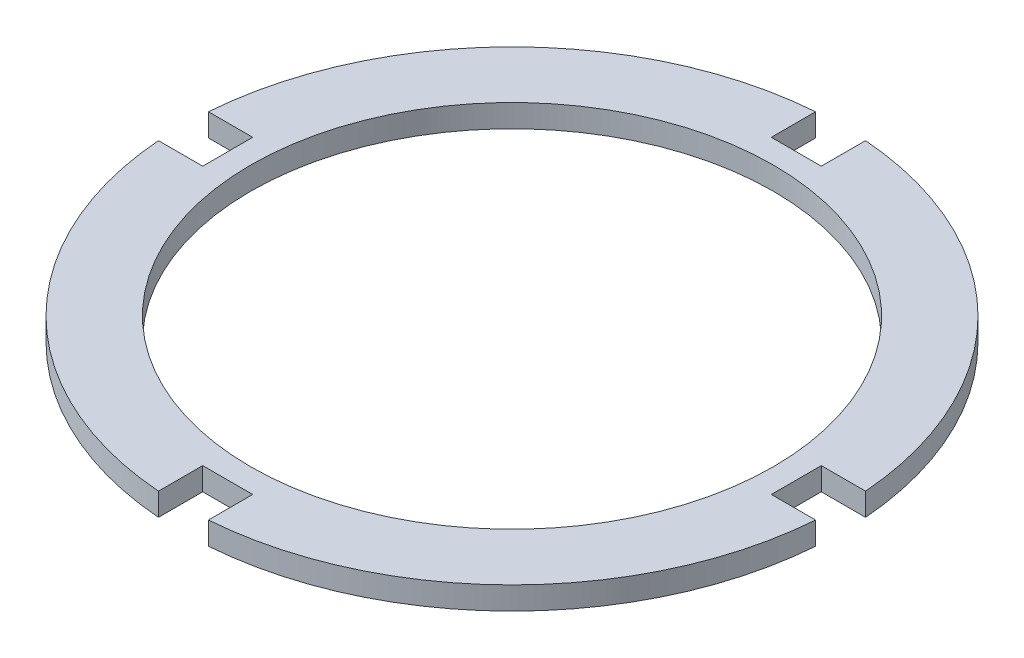
ISO-10303-21;
HEADER;
FILE_DESCRIPTION(('STEP AP214'),'2;1');
FILE_NAME('part.step','',(''),(''),'','','');
FILE_SCHEMA(('AUTOMOTIVE_DESIGN { 1 0 10303 214 1 1 1 1 }'));
ENDSEC;
DATA;
#1=APPLICATION_CONTEXT('core data for automotive mechanical design processes');
#2=APPLICATION_PROTOCOL_DEFINITION('international standard','automotive_design',2000,#1);
#3=PRODUCT_CONTEXT('',#1,'mechanical');
#4=PRODUCT('Part','Part','',(#3));
#5=PRODUCT_RELATED_PRODUCT_CATEGORY('part','',(#4));
#6=PRODUCT_DEFINITION_FORMATION('','',#4);
#7=PRODUCT_DEFINITION_CONTEXT('part definition',#1,'design');
#8=PRODUCT_DEFINITION('design','',#6,#7);
#9=PRODUCT_DEFINITION_SHAPE('','',#8);
#10=(LENGTH_UNIT() NAMED_UNIT(*) SI_UNIT(.MILLI.,.METRE.));
#11=(NAMED_UNIT(*) PLANE_ANGLE_UNIT() SI_UNIT($,.RADIAN.));
#12=(NAMED_UNIT(*) SI_UNIT($,.STERADIAN.) SOLID_ANGLE_UNIT());
#13=UNCERTAINTY_MEASURE_WITH_UNIT(LENGTH_MEASURE(1.E-05),#10,'distance_accuracy_value','');
#14=(GEOMETRIC_REPRESENTATION_CONTEXT(3) GLOBAL_UNCERTAINTY_ASSIGNED_CONTEXT((#13)) GLOBAL_UNIT_ASSIGNED_CONTEXT((#10,
#11,#12)) REPRESENTATION_CONTEXT('',''));
#15=CARTESIAN_POINT('',(0.,0.,0.));
#16=DIRECTION('',(0.,0.,1.));
#17=DIRECTION('',(1.,0.,0.));
#18=AXIS2_PLACEMENT_3D('',#15,#16,#17);
#19=CARTESIAN_POINT('',(6.98500000000221,6.35,0.));
#20=DIRECTION('',(-1.,0.,0.));
#21=DIRECTION('',(0.,0.,1.));
#22=AXIS2_PLACEMENT_3D('',#19,#20,#21);
#23=PLANE('',#22);
#24=DIRECTION('',(0.,0.,-1.));
#25=VECTOR('',#24,1.);
#26=CARTESIAN_POINT('',(6.98500000000221,0.,0.));
#27=LINE('',#26,#25);
#28=CARTESIAN_POINT('',(6.98500000000223,0.,91.8096694253932));
#29=VERTEX_POINT('',#28);
#30=CARTESIAN_POINT('',(6.98500000000223,0.,79.4410399999999));
#31=VERTEX_POINT('',#30);
#32=EDGE_CURVE('E221',#29,#31,#27,.T.);
#33=ORIENTED_EDGE('',*,*,#32,.F.);
#34=DIRECTION('',(0.,-1.,0.));
#35=VECTOR('',#34,1.);
#36=CARTESIAN_POINT('',(6.98500000000223,6.35,91.8096694253932));
#37=LINE('',#36,#35);
#38=CARTESIAN_POINT('',(6.98500000000223,6.35,91.8096694253932));
#39=VERTEX_POINT('',#38);
#40=EDGE_CURVE('E11',#39,#29,#37,.T.);
#41=ORIENTED_EDGE('',*,*,#40,.F.);
#42=DIRECTION('',(0.,0.,-1.));
#43=VECTOR('',#42,1.);
#44=CARTESIAN_POINT('',(6.98500000000221,6.35,0.));
#45=LINE('',#44,#43);
#46=CARTESIAN_POINT('',(6.98500000000223,6.35,79.4410399999999));
#47=VERTEX_POINT('',#46);
#48=EDGE_CURVE('E333',#39,#47,#45,.T.);
#49=ORIENTED_EDGE('',*,*,#48,.T.);
#50=DIRECTION('',(0.,-1.,0.));
#51=VECTOR('',#50,1.);
#52=CARTESIAN_POINT('',(6.98500000000223,6.35,79.4410399999999));
#53=LINE('',#52,#51);
#54=EDGE_CURVE('E55',#47,#31,#53,.T.);
#55=ORIENTED_EDGE('',*,*,#54,.T.);
#56=EDGE_LOOP('',(#33,#41,#49,#55));
#57=FACE_BOUND('',#56,.T.);
#58=ADVANCED_FACE('F38',(#57),#23,.T.);
#59=CARTESIAN_POINT('',(0.,6.35,0.));
#60=DIRECTION('',(0.,-1.,0.));
#61=DIRECTION('',(0.,0.,-1.));
#62=AXIS2_PLACEMENT_3D('',#59,#60,#61);
#63=CYLINDRICAL_SURFACE('',#62,92.075);
#64=CARTESIAN_POINT('',(0.,0.,0.));
#65=DIRECTION('',(0.,1.,0.));
#66=DIRECTION('',(0.,0.,1.));
#67=AXIS2_PLACEMENT_3D('',#64,#65,#66);
#68=CIRCLE('',#67,92.075);
#69=CARTESIAN_POINT('',(91.8096694253934,0.,6.98499999999882));
#70=VERTEX_POINT('',#69);
#71=EDGE_CURVE('E218',#29,#70,#68,.T.);
#72=ORIENTED_EDGE('',*,*,#71,.T.);
#73=DIRECTION('',(0.,-1.,0.));
#74=VECTOR('',#73,1.);
#75=CARTESIAN_POINT('',(91.8096694253934,6.35,6.98499999999882));
#76=LINE('',#75,#74);
#77=CARTESIAN_POINT('',(91.8096694253934,6.35,6.98499999999882));
#78=VERTEX_POINT('',#77);
#79=EDGE_CURVE('E47',#78,#70,#76,.T.);
#80=ORIENTED_EDGE('',*,*,#79,.F.);
#81=CARTESIAN_POINT('',(0.,6.35,0.));
#82=DIRECTION('',(0.,1.,0.));
#83=DIRECTION('',(0.,0.,1.));
#84=AXIS2_PLACEMENT_3D('',#81,#82,#83);
#85=CIRCLE('',#84,92.075);
#86=EDGE_CURVE('E174',#39,#78,#85,.T.);
#87=ORIENTED_EDGE('',*,*,#86,.F.);
#88=ORIENTED_EDGE('',*,*,#40,.T.);
#89=EDGE_LOOP('',(#72,#80,#87,#88));
#90=FACE_BOUND('',#89,.T.);
#91=ADVANCED_FACE('F219',(#90),#63,.T.);
#92=CARTESIAN_POINT('',(0.,6.35,6.98499999999883));
#93=DIRECTION('',(0.,0.,1.));
#94=DIRECTION('',(1.,0.,0.));
#95=AXIS2_PLACEMENT_3D('',#92,#93,#94);
#96=PLANE('',#95);
#97=DIRECTION('',(-1.,0.,0.));
#98=VECTOR('',#97,1.);
#99=CARTESIAN_POINT('',(0.,0.,6.98499999999883));
#100=LINE('',#99,#98);
#101=CARTESIAN_POINT('',(79.441040000001,0.,6.98499999999882));
#102=VERTEX_POINT('',#101);
#103=EDGE_CURVE('E212',#70,#102,#100,.T.);
#104=ORIENTED_EDGE('',*,*,#103,.T.);
#105=DIRECTION('',(0.,-1.,0.));
#106=VECTOR('',#105,1.);
#107=CARTESIAN_POINT('',(79.441040000001,6.35,6.98499999999882));
#108=LINE('',#107,#106);
#109=CARTESIAN_POINT('',(79.441040000001,6.35,6.98499999999882));
#110=VERTEX_POINT('',#109);
#111=EDGE_CURVE('E204',#110,#102,#108,.T.);
#112=ORIENTED_EDGE('',*,*,#111,.F.);
#113=DIRECTION('',(-1.,0.,0.));
#114=VECTOR('',#113,1.);
#115=CARTESIAN_POINT('',(0.,6.35,6.98499999999883));
#116=LINE('',#115,#114);
#117=EDGE_CURVE('E214',#78,#110,#116,.T.);
#118=ORIENTED_EDGE('',*,*,#117,.F.);
#119=ORIENTED_EDGE('',*,*,#79,.T.);
#120=EDGE_LOOP('',(#104,#112,#118,#119));
#121=FACE_BOUND('',#120,.T.);
#122=ADVANCED_FACE('F210',(#121),#96,.F.);
#123=CARTESIAN_POINT('',(79.441040000001,6.35,0.));
#124=DIRECTION('',(1.,0.,0.));
#125=DIRECTION('',(0.,0.,-1.));
#126=AXIS2_PLACEMENT_3D('',#123,#124,#125);
#127=PLANE('',#126);
#128=DIRECTION('',(0.,0.,1.));
#129=VECTOR('',#128,1.);
#130=CARTESIAN_POINT('',(79.441040000001,0.,0.));
#131=LINE('',#130,#129);
#132=CARTESIAN_POINT('',(79.441040000001,0.,-6.98500000000118));
#133=VERTEX_POINT('',#132);
#134=EDGE_CURVE('E224',#133,#102,#131,.T.);
#135=ORIENTED_EDGE('',*,*,#134,.F.);
#136=DIRECTION('',(0.,-1.,0.));
#137=VECTOR('',#136,1.);
#138=CARTESIAN_POINT('',(79.441040000001,6.35,-6.98500000000118));
#139=LINE('',#138,#137);
#140=CARTESIAN_POINT('',(79.441040000001,6.35,-6.98500000000118));
#141=VERTEX_POINT('',#140);
#142=EDGE_CURVE('E202',#141,#133,#139,.T.);
#143=ORIENTED_EDGE('',*,*,#142,.F.);
#144=DIRECTION('',(0.,0.,1.));
#145=VECTOR('',#144,1.);
#146=CARTESIAN_POINT('',(79.441040000001,6.35,0.));
#147=LINE('',#146,#145);
#148=EDGE_CURVE('E339',#141,#110,#147,.T.);
#149=ORIENTED_EDGE('',*,*,#148,.T.);
#150=ORIENTED_EDGE('',*,*,#111,.T.);
#151=EDGE_LOOP('',(#135,#143,#149,#150));
#152=FACE_BOUND('',#151,.T.);
#153=ADVANCED_FACE('F292',(#152),#127,.T.);
#154=CARTESIAN_POINT('',(0.,6.35,-6.98500000000117));
#155=DIRECTION('',(0.,0.,1.));
#156=DIRECTION('',(1.,0.,0.));
#157=AXIS2_PLACEMENT_3D('',#154,#155,#156);
#158=PLANE('',#157);
#159=DIRECTION('',(-1.,0.,0.));
#160=VECTOR('',#159,1.);
#161=CARTESIAN_POINT('',(0.,0.,-6.98500000000117));
#162=LINE('',#161,#160);
#163=CARTESIAN_POINT('',(91.8096694253932,0.,-6.98500000000119));
#164=VERTEX_POINT('',#163);
#165=EDGE_CURVE('E233',#164,#133,#162,.T.);
#166=ORIENTED_EDGE('',*,*,#165,.F.);
#167=DIRECTION('',(0.,-1.,0.));
#168=VECTOR('',#167,1.);
#169=CARTESIAN_POINT('',(91.8096694253932,6.35,-6.98500000000119));
#170=LINE('',#169,#168);
#171=CARTESIAN_POINT('',(91.8096694253932,6.35,-6.98500000000119));
#172=VERTEX_POINT('',#171);
#173=EDGE_CURVE('E200',#172,#164,#170,.T.);
#174=ORIENTED_EDGE('',*,*,#173,.F.);
#175=DIRECTION('',(-1.,0.,0.));
#176=VECTOR('',#175,1.);
#177=CARTESIAN_POINT('',(0.,6.35,-6.98500000000117));
#178=LINE('',#177,#176);
#179=EDGE_CURVE('E342',#172,#141,#178,.T.);
#180=ORIENTED_EDGE('',*,*,#179,.T.);
#181=ORIENTED_EDGE('',*,*,#142,.T.);
#182=EDGE_LOOP('',(#166,#174,#180,#181));
#183=FACE_BOUND('',#182,.T.);
#184=ADVANCED_FACE('F295',(#183),#158,.T.);
#185=CARTESIAN_POINT('',(6.985,0.,-91.8096694253933));
#186=VERTEX_POINT('',#185);
#187=EDGE_CURVE('E223',#164,#186,#68,.T.);
#188=ORIENTED_EDGE('',*,*,#187,.T.);
#189=DIRECTION('',(0.,-1.,0.));
#190=VECTOR('',#189,1.);
#191=CARTESIAN_POINT('',(6.985,6.35,-91.8096694253933));
#192=LINE('',#191,#190);
#193=CARTESIAN_POINT('',(6.985,6.35,-91.8096694253933));
#194=VERTEX_POINT('',#193);
#195=EDGE_CURVE('E197',#194,#186,#192,.T.);
#196=ORIENTED_EDGE('',*,*,#195,.F.);
#197=EDGE_CURVE('E337',#172,#194,#85,.T.);
#198=ORIENTED_EDGE('',*,*,#197,.F.);
#199=ORIENTED_EDGE('',*,*,#173,.T.);
#200=EDGE_LOOP('',(#188,#196,#198,#199));
#201=FACE_BOUND('',#200,.T.);
#202=ADVANCED_FACE('F288',(#201),#63,.T.);
#203=CARTESIAN_POINT('',(6.98500000000001,6.35,0.));
#204=DIRECTION('',(1.,0.,0.));
#205=DIRECTION('',(0.,0.,-1.));
#206=AXIS2_PLACEMENT_3D('',#203,#204,#205);
#207=PLANE('',#206);
#208=DIRECTION('',(0.,0.,1.));
#209=VECTOR('',#208,1.);
#210=CARTESIAN_POINT('',(6.98500000000001,0.,0.));
#211=LINE('',#210,#209);
#212=CARTESIAN_POINT('',(6.985,0.,-79.44104));
#213=VERTEX_POINT('',#212);
#214=EDGE_CURVE('E232',#186,#213,#211,.T.);
#215=ORIENTED_EDGE('',*,*,#214,.T.);
#216=DIRECTION('',(0.,-1.,0.));
#217=VECTOR('',#216,1.);
#218=CARTESIAN_POINT('',(6.985,6.35,-79.44104));
#219=LINE('',#218,#217);
#220=CARTESIAN_POINT('',(6.985,6.35,-79.44104));
#221=VERTEX_POINT('',#220);
#222=EDGE_CURVE('E195',#221,#213,#219,.T.);
#223=ORIENTED_EDGE('',*,*,#222,.F.);
#224=DIRECTION('',(0.,0.,1.));
#225=VECTOR('',#224,1.);
#226=CARTESIAN_POINT('',(6.98500000000001,6.35,0.));
#227=LINE('',#226,#225);
#228=EDGE_CURVE('E345',#194,#221,#227,.T.);
#229=ORIENTED_EDGE('',*,*,#228,.F.);
#230=ORIENTED_EDGE('',*,*,#195,.T.);
#231=EDGE_LOOP('',(#215,#223,#229,#230));
#232=FACE_BOUND('',#231,.T.);
#233=ADVANCED_FACE('F300',(#232),#207,.F.);
#234=CARTESIAN_POINT('',(0.,6.35,-79.44104));
#235=DIRECTION('',(0.,0.,-1.));
#236=DIRECTION('',(-1.,0.,0.));
#237=AXIS2_PLACEMENT_3D('',#234,#235,#236);
#238=PLANE('',#237);
#239=DIRECTION('',(1.,0.,0.));
#240=VECTOR('',#239,1.);
#241=CARTESIAN_POINT('',(0.,0.,-79.44104));
#242=LINE('',#241,#240);
#243=CARTESIAN_POINT('',(-6.985,0.,-79.44104));
#244=VERTEX_POINT('',#243);
#245=EDGE_CURVE('E238',#244,#213,#242,.T.);
#246=ORIENTED_EDGE('',*,*,#245,.F.);
#247=DIRECTION('',(0.,-1.,0.));
#248=VECTOR('',#247,1.);
#249=CARTESIAN_POINT('',(-6.985,6.35,-79.44104));
#250=LINE('',#249,#248);
#251=CARTESIAN_POINT('',(-6.985,6.35,-79.44104));
#252=VERTEX_POINT('',#251);
#253=EDGE_CURVE('E193',#252,#244,#250,.T.);
#254=ORIENTED_EDGE('',*,*,#253,.F.);
#255=DIRECTION('',(1.,0.,0.));
#256=VECTOR('',#255,1.);
#257=CARTESIAN_POINT('',(0.,6.35,-79.44104));
#258=LINE('',#257,#256);
#259=EDGE_CURVE('E347',#252,#221,#258,.T.);
#260=ORIENTED_EDGE('',*,*,#259,.T.);
#261=ORIENTED_EDGE('',*,*,#222,.T.);
#262=EDGE_LOOP('',(#246,#254,#260,#261));
#263=FACE_BOUND('',#262,.T.);
#264=ADVANCED_FACE('F303',(#263),#238,.T.);
#265=CARTESIAN_POINT('',(-6.98499999999999,6.35,0.));
#266=DIRECTION('',(1.,0.,0.));
#267=DIRECTION('',(0.,0.,-1.));
#268=AXIS2_PLACEMENT_3D('',#265,#266,#267);
#269=PLANE('',#268);
#270=DIRECTION('',(0.,0.,1.));
#271=VECTOR('',#270,1.);
#272=CARTESIAN_POINT('',(-6.98499999999999,0.,0.));
#273=LINE('',#272,#271);
#274=CARTESIAN_POINT('',(-6.985,0.,-91.8096694253933));
#275=VERTEX_POINT('',#274);
#276=EDGE_CURVE('E244',#275,#244,#273,.T.);
#277=ORIENTED_EDGE('',*,*,#276,.F.);
#278=DIRECTION('',(0.,-1.,0.));
#279=VECTOR('',#278,1.);
#280=CARTESIAN_POINT('',(-6.985,6.35,-91.8096694253933));
#281=LINE('',#280,#279);
#282=CARTESIAN_POINT('',(-6.985,6.35,-91.8096694253933));
#283=VERTEX_POINT('',#282);
#284=EDGE_CURVE('E191',#283,#275,#281,.T.);
#285=ORIENTED_EDGE('',*,*,#284,.F.);
#286=DIRECTION('',(0.,0.,1.));
#287=VECTOR('',#286,1.);
#288=CARTESIAN_POINT('',(-6.98499999999999,6.35,0.));
#289=LINE('',#288,#287);
#290=EDGE_CURVE('E350',#283,#252,#289,.T.);
#291=ORIENTED_EDGE('',*,*,#290,.T.);
#292=ORIENTED_EDGE('',*,*,#253,.T.);
#293=EDGE_LOOP('',(#277,#285,#291,#292));
#294=FACE_BOUND('',#293,.T.);
#295=ADVANCED_FACE('F307',(#294),#269,.T.);
#296=CARTESIAN_POINT('',(-91.8096694253934,0.,-6.98499999999894));
#297=VERTEX_POINT('',#296);
#298=EDGE_CURVE('E230',#275,#297,#68,.T.);
#299=ORIENTED_EDGE('',*,*,#298,.T.);
#300=DIRECTION('',(0.,-1.,0.));
#301=VECTOR('',#300,1.);
#302=CARTESIAN_POINT('',(-91.8096694253934,6.35,-6.98499999999894));
#303=LINE('',#302,#301);
#304=CARTESIAN_POINT('',(-91.8096694253934,6.35,-6.98499999999894));
#305=VERTEX_POINT('',#304);
#306=EDGE_CURVE('E188',#305,#297,#303,.T.);
#307=ORIENTED_EDGE('',*,*,#306,.F.);
#308=EDGE_CURVE('E173',#283,#305,#85,.T.);
#309=ORIENTED_EDGE('',*,*,#308,.F.);
#310=ORIENTED_EDGE('',*,*,#284,.T.);
#311=EDGE_LOOP('',(#299,#307,#309,#310));
#312=FACE_BOUND('',#311,.T.);
#313=ADVANCED_FACE('F311',(#312),#63,.T.);
#314=CARTESIAN_POINT('',(0.,6.35,-6.98499999999897));
#315=DIRECTION('',(0.,0.,-1.));
#316=DIRECTION('',(-1.,0.,0.));
#317=AXIS2_PLACEMENT_3D('',#314,#315,#316);
#318=PLANE('',#317);
#319=DIRECTION('',(1.,0.,0.));
#320=VECTOR('',#319,1.);
#321=CARTESIAN_POINT('',(0.,0.,-6.98499999999897));
#322=LINE('',#321,#320);
#323=CARTESIAN_POINT('',(-79.4410399999988,0.,-6.98499999999895));
#324=VERTEX_POINT('',#323);
#325=EDGE_CURVE('E243',#297,#324,#322,.T.);
#326=ORIENTED_EDGE('',*,*,#325,.T.);
#327=DIRECTION('',(0.,-1.,0.));
#328=VECTOR('',#327,1.);
#329=CARTESIAN_POINT('',(-79.4410399999988,6.35,-6.98499999999895));
#330=LINE('',#329,#328);
#331=CARTESIAN_POINT('',(-79.4410399999988,6.35,-6.98499999999895));
#332=VERTEX_POINT('',#331);
#333=EDGE_CURVE('E186',#332,#324,#330,.T.);
#334=ORIENTED_EDGE('',*,*,#333,.F.);
#335=DIRECTION('',(1.,0.,0.));
#336=VECTOR('',#335,1.);
#337=CARTESIAN_POINT('',(0.,6.35,-6.98499999999897));
#338=LINE('',#337,#336);
#339=EDGE_CURVE('E353',#305,#332,#338,.T.);
#340=ORIENTED_EDGE('',*,*,#339,.F.);
#341=ORIENTED_EDGE('',*,*,#306,.T.);
#342=EDGE_LOOP('',(#326,#334,#340,#341));
#343=FACE_BOUND('',#342,.T.);
#344=ADVANCED_FACE('F313',(#343),#318,.F.);
#345=CARTESIAN_POINT('',(-79.4410399999988,6.35,0.));
#346=DIRECTION('',(-1.,0.,0.));
#347=DIRECTION('',(0.,0.,1.));
#348=AXIS2_PLACEMENT_3D('',#345,#346,#347);
#349=PLANE('',#348);
#350=DIRECTION('',(0.,0.,-1.));
#351=VECTOR('',#350,1.);
#352=CARTESIAN_POINT('',(-79.4410399999988,0.,0.));
#353=LINE('',#352,#351);
#354=CARTESIAN_POINT('',(-79.4410399999988,0.,6.98500000000106));
#355=VERTEX_POINT('',#354);
#356=EDGE_CURVE('E249',#355,#324,#353,.T.);
#357=ORIENTED_EDGE('',*,*,#356,.F.);
#358=DIRECTION('',(0.,-1.,0.));
#359=VECTOR('',#358,1.);
#360=CARTESIAN_POINT('',(-79.4410399999988,6.35,6.98500000000106));
#361=LINE('',#360,#359);
#362=CARTESIAN_POINT('',(-79.4410399999988,6.35,6.98500000000106));
#363=VERTEX_POINT('',#362);
#364=EDGE_CURVE('E180',#363,#355,#361,.T.);
#365=ORIENTED_EDGE('',*,*,#364,.F.);
#366=DIRECTION('',(0.,0.,-1.));
#367=VECTOR('',#366,1.);
#368=CARTESIAN_POINT('',(-79.4410399999988,6.35,0.));
#369=LINE('',#368,#367);
#370=EDGE_CURVE('E355',#363,#332,#369,.T.);
#371=ORIENTED_EDGE('',*,*,#370,.T.);
#372=ORIENTED_EDGE('',*,*,#333,.T.);
#373=EDGE_LOOP('',(#357,#365,#371,#372));
#374=FACE_BOUND('',#373,.T.);
#375=ADVANCED_FACE('F316',(#374),#349,.T.);
#376=CARTESIAN_POINT('',(0.,6.35,6.98500000000103));
#377=DIRECTION('',(0.,0.,-1.));
#378=DIRECTION('',(-1.,0.,0.));
#379=AXIS2_PLACEMENT_3D('',#376,#377,#378);
#380=PLANE('',#379);
#381=DIRECTION('',(1.,0.,0.));
#382=VECTOR('',#381,1.);
#383=CARTESIAN_POINT('',(0.,0.,6.98500000000103));
#384=LINE('',#383,#382);
#385=CARTESIAN_POINT('',(-91.8096694253932,0.,6.98500000000106));
#386=VERTEX_POINT('',#385);
#387=EDGE_CURVE('E229',#386,#355,#384,.T.);
#388=ORIENTED_EDGE('',*,*,#387,.F.);
#389=DIRECTION('',(0.,-1.,0.));
#390=VECTOR('',#389,1.);
#391=CARTESIAN_POINT('',(-91.8096694253932,6.35,6.98500000000106));
#392=LINE('',#391,#390);
#393=CARTESIAN_POINT('',(-91.8096694253932,6.35,6.98500000000106));
#394=VERTEX_POINT('',#393);
#395=EDGE_CURVE('E178',#394,#386,#392,.T.);
#396=ORIENTED_EDGE('',*,*,#395,.F.);
#397=DIRECTION('',(1.,0.,0.));
#398=VECTOR('',#397,1.);
#399=CARTESIAN_POINT('',(0.,6.35,6.98500000000103));
#400=LINE('',#399,#398);
#401=EDGE_CURVE('E170',#394,#363,#400,.T.);
#402=ORIENTED_EDGE('',*,*,#401,.T.);
#403=ORIENTED_EDGE('',*,*,#364,.T.);
#404=EDGE_LOOP('',(#388,#396,#402,#403));
#405=FACE_BOUND('',#404,.T.);
#406=ADVANCED_FACE('F320',(#405),#380,.T.);
#407=CARTESIAN_POINT('',(-6.98499999999777,0.,91.8096694253935));
#408=VERTEX_POINT('',#407);
#409=EDGE_CURVE('E177',#386,#408,#68,.T.);
#410=ORIENTED_EDGE('',*,*,#409,.T.);
#411=DIRECTION('',(0.,-1.,0.));
#412=VECTOR('',#411,1.);
#413=CARTESIAN_POINT('',(-6.98499999999777,6.35,91.8096694253935));
#414=LINE('',#413,#412);
#415=CARTESIAN_POINT('',(-6.98499999999777,6.35,91.8096694253935));
#416=VERTEX_POINT('',#415);
#417=EDGE_CURVE('E157',#416,#408,#414,.T.);
#418=ORIENTED_EDGE('',*,*,#417,.F.);
#419=EDGE_CURVE('E162',#394,#416,#85,.T.);
#420=ORIENTED_EDGE('',*,*,#419,.F.);
#421=ORIENTED_EDGE('',*,*,#395,.T.);
#422=EDGE_LOOP('',(#410,#418,#420,#421));
#423=FACE_BOUND('',#422,.T.);
#424=ADVANCED_FACE('F175',(#423),#63,.T.);
#425=CARTESIAN_POINT('',(-6.98499999999779,6.35,0.));
#426=DIRECTION('',(-1.,0.,0.));
#427=DIRECTION('',(0.,0.,1.));
#428=AXIS2_PLACEMENT_3D('',#425,#426,#427);
#429=PLANE('',#428);
#430=DIRECTION('',(0.,0.,-1.));
#431=VECTOR('',#430,1.);
#432=CARTESIAN_POINT('',(-6.98499999999779,0.,0.));
#433=LINE('',#432,#431);
#434=CARTESIAN_POINT('',(-6.98499999999777,0.,79.4410399999999));
#435=VERTEX_POINT('',#434);
#436=EDGE_CURVE('E228',#408,#435,#433,.T.);
#437=ORIENTED_EDGE('',*,*,#436,.T.);
#438=DIRECTION('',(0.,-1.,0.));
#439=VECTOR('',#438,1.);
#440=CARTESIAN_POINT('',(-6.98499999999777,6.35,79.4410399999999));
#441=LINE('',#440,#439);
#442=CARTESIAN_POINT('',(-6.98499999999777,6.35,79.4410399999999));
#443=VERTEX_POINT('',#442);
#444=EDGE_CURVE('E105',#443,#435,#441,.T.);
#445=ORIENTED_EDGE('',*,*,#444,.F.);
#446=DIRECTION('',(0.,0.,-1.));
#447=VECTOR('',#446,1.);
#448=CARTESIAN_POINT('',(-6.98499999999779,6.35,0.));
#449=LINE('',#448,#447);
#450=EDGE_CURVE('E153',#416,#443,#449,.T.);
#451=ORIENTED_EDGE('',*,*,#450,.F.);
#452=ORIENTED_EDGE('',*,*,#417,.T.);
#453=EDGE_LOOP('',(#437,#445,#451,#452));
#454=FACE_BOUND('',#453,.T.);
#455=ADVANCED_FACE('F155',(#454),#429,.F.);
#456=CARTESIAN_POINT('',(0.,6.35,0.));
#457=DIRECTION('',(0.,-1.,0.));
#458=DIRECTION('',(0.,0.,-1.));
#459=AXIS2_PLACEMENT_3D('',#456,#457,#458);
#460=CYLINDRICAL_SURFACE('',#459,73.025);
#461=CARTESIAN_POINT('',(0.,6.35,0.));
#462=DIRECTION('',(0.,1.,0.));
#463=DIRECTION('',(0.,0.,1.));
#464=AXIS2_PLACEMENT_3D('',#461,#462,#463);
#465=CIRCLE('',#464,73.025);
#466=CARTESIAN_POINT('',(0.,6.35,73.025));
#467=VERTEX_POINT('',#466);
#468=EDGE_CURVE('E264',#467,#467,#465,.T.);
#469=ORIENTED_EDGE('',*,*,#468,.T.);
#470=EDGE_LOOP('',(#469));
#471=FACE_BOUND('',#470,.T.);
#472=CARTESIAN_POINT('',(0.,0.,0.));
#473=DIRECTION('',(0.,1.,0.));
#474=DIRECTION('',(0.,0.,1.));
#475=AXIS2_PLACEMENT_3D('',#472,#473,#474);
#476=CIRCLE('',#475,73.025);
#477=CARTESIAN_POINT('',(0.,0.,73.025));
#478=VERTEX_POINT('',#477);
#479=EDGE_CURVE('E226',#478,#478,#476,.T.);
#480=ORIENTED_EDGE('',*,*,#479,.F.);
#481=EDGE_LOOP('',(#480));
#482=FACE_BOUND('',#481,.T.);
#483=ADVANCED_FACE('F40',(#471,#482),#460,.F.);
#484=CARTESIAN_POINT('',(0.,6.35,79.4410399999999));
#485=DIRECTION('',(0.,0.,1.));
#486=DIRECTION('',(1.,0.,0.));
#487=AXIS2_PLACEMENT_3D('',#484,#485,#486);
#488=PLANE('',#487);
#489=DIRECTION('',(-1.,0.,0.));
#490=VECTOR('',#489,1.);
#491=CARTESIAN_POINT('',(0.,0.,79.4410399999999));
#492=LINE('',#491,#490);
#493=EDGE_CURVE('E262',#31,#435,#492,.T.);
#494=ORIENTED_EDGE('',*,*,#493,.F.);
#495=ORIENTED_EDGE('',*,*,#54,.F.);
#496=DIRECTION('',(-1.,0.,0.));
#497=VECTOR('',#496,1.);
#498=CARTESIAN_POINT('',(0.,6.35,79.4410399999999));
#499=LINE('',#498,#497);
#500=EDGE_CURVE('E161',#47,#443,#499,.T.);
#501=ORIENTED_EDGE('',*,*,#500,.T.);
#502=ORIENTED_EDGE('',*,*,#444,.T.);
#503=EDGE_LOOP('',(#494,#495,#501,#502));
#504=FACE_BOUND('',#503,.T.);
#505=ADVANCED_FACE('F274',(#504),#488,.T.);
#506=CARTESIAN_POINT('',(0.,6.35,0.));
#507=DIRECTION('',(0.,1.,0.));
#508=DIRECTION('',(0.,0.,1.));
#509=AXIS2_PLACEMENT_3D('',#506,#507,#508);
#510=PLANE('',#509);
#511=ORIENTED_EDGE('',*,*,#468,.F.);
#512=EDGE_LOOP('',(#511));
#513=FACE_BOUND('',#512,.T.);
#514=ORIENTED_EDGE('',*,*,#48,.F.);
#515=ORIENTED_EDGE('',*,*,#86,.T.);
#516=ORIENTED_EDGE('',*,*,#117,.T.);
#517=ORIENTED_EDGE('',*,*,#148,.F.);
#518=ORIENTED_EDGE('',*,*,#179,.F.);
#519=ORIENTED_EDGE('',*,*,#197,.T.);
#520=ORIENTED_EDGE('',*,*,#228,.T.);
#521=ORIENTED_EDGE('',*,*,#259,.F.);
#522=ORIENTED_EDGE('',*,*,#290,.F.);
#523=ORIENTED_EDGE('',*,*,#308,.T.);
#524=ORIENTED_EDGE('',*,*,#339,.T.);
#525=ORIENTED_EDGE('',*,*,#370,.F.);
#526=ORIENTED_EDGE('',*,*,#401,.F.);
#527=ORIENTED_EDGE('',*,*,#419,.T.);
#528=ORIENTED_EDGE('',*,*,#450,.T.);
#529=ORIENTED_EDGE('',*,*,#500,.F.);
#530=EDGE_LOOP('',(#514,#515,#516,#517,#518,#519,#520,#521,#522,#523,#524,#525,#526,#527,#528,#529));
#531=FACE_BOUND('',#530,.T.);
#532=ADVANCED_FACE('F167',(#513,#531),#510,.T.);
#533=CARTESIAN_POINT('',(0.,0.,0.));
#534=DIRECTION('',(0.,1.,0.));
#535=DIRECTION('',(0.,0.,1.));
#536=AXIS2_PLACEMENT_3D('',#533,#534,#535);
#537=PLANE('',#536);
#538=ORIENTED_EDGE('',*,*,#479,.T.);
#539=EDGE_LOOP('',(#538));
#540=FACE_BOUND('',#539,.T.);
#541=ORIENTED_EDGE('',*,*,#32,.T.);
#542=ORIENTED_EDGE('',*,*,#493,.T.);
#543=ORIENTED_EDGE('',*,*,#436,.F.);
#544=ORIENTED_EDGE('',*,*,#409,.F.);
#545=ORIENTED_EDGE('',*,*,#387,.T.);
#546=ORIENTED_EDGE('',*,*,#356,.T.);
#547=ORIENTED_EDGE('',*,*,#325,.F.);
#548=ORIENTED_EDGE('',*,*,#298,.F.);
#549=ORIENTED_EDGE('',*,*,#276,.T.);
#550=ORIENTED_EDGE('',*,*,#245,.T.);
#551=ORIENTED_EDGE('',*,*,#214,.F.);
#552=ORIENTED_EDGE('',*,*,#187,.F.);
#553=ORIENTED_EDGE('',*,*,#165,.T.);
#554=ORIENTED_EDGE('',*,*,#134,.T.);
#555=ORIENTED_EDGE('',*,*,#103,.F.);
#556=ORIENTED_EDGE('',*,*,#71,.F.);
#557=EDGE_LOOP('',(#541,#542,#543,#544,#545,#546,#547,#548,#549,#550,#551,#552,#553,#554,#555,#556));
#558=FACE_BOUND('',#557,.T.);
#559=ADVANCED_FACE('F271',(#540,#558),#537,.F.);
#560=CLOSED_SHELL('',(#58,#91,#122,#153,#184,#202,#233,#264,#295,#313,#344,#375,#406,#424,#455,
#483,#505,#532,#559));
#561=MANIFOLD_SOLID_BREP('B2',#560);
#562=ADVANCED_BREP_SHAPE_REPRESENTATION('',(#18,#561),#14);
#563=SHAPE_DEFINITION_REPRESENTATION(#9,#562);
ENDSEC;
END-ISO-10303-21;
